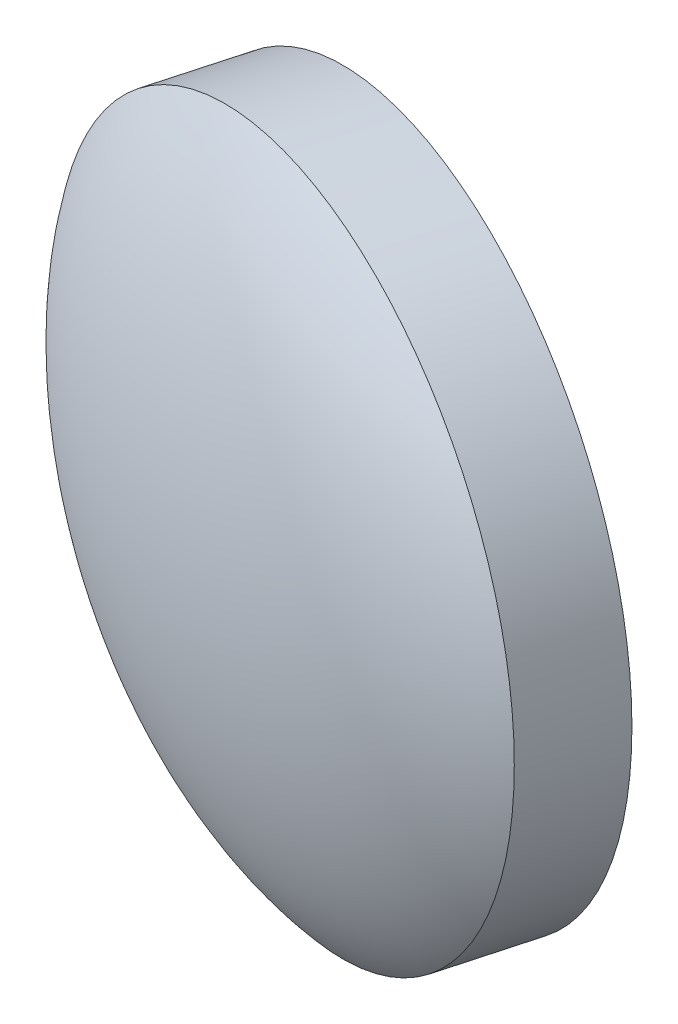
ISO-10303-21;
HEADER;
FILE_DESCRIPTION(('STEP AP214'),'2;1');
FILE_NAME('part.step','',(''),(''),'','','');
FILE_SCHEMA(('AUTOMOTIVE_DESIGN { 1 0 10303 214 1 1 1 1 }'));
ENDSEC;
DATA;
#1=APPLICATION_CONTEXT('core data for automotive mechanical design processes');
#2=APPLICATION_PROTOCOL_DEFINITION('international standard','automotive_design',2000,#1);
#3=PRODUCT_CONTEXT('',#1,'mechanical');
#4=PRODUCT('Part','Part','',(#3));
#5=PRODUCT_RELATED_PRODUCT_CATEGORY('part','',(#4));
#6=PRODUCT_DEFINITION_FORMATION('','',#4);
#7=PRODUCT_DEFINITION_CONTEXT('part definition',#1,'design');
#8=PRODUCT_DEFINITION('design','',#6,#7);
#9=PRODUCT_DEFINITION_SHAPE('','',#8);
#10=(LENGTH_UNIT() NAMED_UNIT(*) SI_UNIT(.MILLI.,.METRE.));
#11=(NAMED_UNIT(*) PLANE_ANGLE_UNIT() SI_UNIT($,.RADIAN.));
#12=(NAMED_UNIT(*) SI_UNIT($,.STERADIAN.) SOLID_ANGLE_UNIT());
#13=UNCERTAINTY_MEASURE_WITH_UNIT(LENGTH_MEASURE(1.E-05),#10,'distance_accuracy_value','');
#14=(GEOMETRIC_REPRESENTATION_CONTEXT(3) GLOBAL_UNCERTAINTY_ASSIGNED_CONTEXT((#13)) GLOBAL_UNIT_ASSIGNED_CONTEXT((#10,
#11,#12)) REPRESENTATION_CONTEXT('',''));
#15=CARTESIAN_POINT('',(0.,0.,0.));
#16=DIRECTION('',(0.,0.,1.));
#17=DIRECTION('',(1.,0.,0.));
#18=AXIS2_PLACEMENT_3D('',#15,#16,#17);
#19=CARTESIAN_POINT('',(-185.803418128199,0.,-51.0566088952039));
#20=DIRECTION('',(-0.264966713613981,0.,0.964257559304881));
#21=DIRECTION('',(0.964257559304881,0.,0.264966713613981));
#22=AXIS2_PLACEMENT_3D('',#19,#20,#21);
#23=PLANE('',#22);
#24=CARTESIAN_POINT('',(0.,0.,0.));
#25=DIRECTION('',(-0.264966713613981,0.,0.964257559304881));
#26=DIRECTION('',(0.964257559304881,0.,0.264966713613981));
#27=AXIS2_PLACEMENT_3D('',#24,#25,#26);
#28=CIRCLE('',#27,192.690652342038);
#29=CARTESIAN_POINT('',(185.803418128199,0.,51.0566088952039));
#30=VERTEX_POINT('',#29);
#31=EDGE_CURVE('E60',#30,#30,#28,.T.);
#32=ORIENTED_EDGE('',*,*,#31,.T.);
#33=EDGE_LOOP('',(#32));
#34=FACE_BOUND('',#33,.T.);
#35=CARTESIAN_POINT('',(0.,0.,0.));
#36=DIRECTION('',(-0.264966713613981,0.,0.964257559304881));
#37=DIRECTION('',(0.964257559304881,0.,0.264966713613981));
#38=AXIS2_PLACEMENT_3D('',#35,#36,#37);
#39=CIRCLE('',#38,194.690652342038);
#40=CARTESIAN_POINT('',(187.731933246808,0.,51.5865423224319));
#41=VERTEX_POINT('',#40);
#42=EDGE_CURVE('E11',#41,#41,#39,.T.);
#43=ORIENTED_EDGE('',*,*,#42,.F.);
#44=EDGE_LOOP('',(#43));
#45=FACE_BOUND('',#44,.T.);
#46=ADVANCED_FACE('F36',(#34,#45),#23,.F.);
#47=CARTESIAN_POINT('',(-29.4775468895554,0.,107.273653472668));
#48=DIRECTION('',(-0.264966713613981,0.,0.964257559304881));
#49=DIRECTION('',(0.964257559304881,0.,0.264966713613981));
#50=AXIS2_PLACEMENT_3D('',#47,#48,#49);
#51=CYLINDRICAL_SURFACE('',#50,194.690652342038);
#52=CARTESIAN_POINT('',(-14.9797428878167,0.,54.5137542712785));
#53=DIRECTION('',(-0.264966713613981,0.,0.964257559304881));
#54=DIRECTION('',(0.964257559304881,0.,0.264966713613981));
#55=AXIS2_PLACEMENT_3D('',#52,#53,#54);
#56=CIRCLE('',#55,194.690652342038);
#57=CARTESIAN_POINT('',(172.752190358992,0.,106.10029659371));
#58=VERTEX_POINT('',#57);
#59=EDGE_CURVE('E45',#58,#58,#56,.T.);
#60=ORIENTED_EDGE('',*,*,#59,.F.);
#61=EDGE_LOOP('',(#60));
#62=FACE_BOUND('',#61,.T.);
#63=ORIENTED_EDGE('',*,*,#42,.T.);
#64=EDGE_LOOP('',(#63));
#65=FACE_BOUND('',#64,.T.);
#66=ADVANCED_FACE('F72',(#62,#65),#51,.T.);
#67=CARTESIAN_POINT('',(0.,0.,0.));
#68=DIRECTION('',(0.,1.,0.));
#69=DIRECTION('',(-0.964257559304881,0.,-0.264966713613981));
#70=AXIS2_PLACEMENT_3D('',#67,#68,#69);
#71=ELLIPSE('',#70,222.5,111.25);
#72=TRIMMED_CURVE('',#71,(PARAMETER_VALUE(-1.5707963267949)),(PARAMETER_VALUE(1.5707963267949)),
.T.,.PARAMETER.);
#73=CARTESIAN_POINT('',(-29.4775468895554,0.,107.273653472668));
#74=DIRECTION('',(-0.264966713613981,0.,0.964257559304881));
#75=AXIS1_PLACEMENT('',#73,#74);
#76=SURFACE_OF_REVOLUTION('',#72,#75);
#77=OFFSET_SURFACE('',#76,2.,.F.);
#78=CARTESIAN_POINT('',(-30.0074803167834,0.,109.202168591278));
#79=VERTEX_POINT('',#78);
#80=VERTEX_LOOP('',#79);
#81=FACE_BOUND('',#80,.T.);
#82=ORIENTED_EDGE('',*,*,#59,.T.);
#83=EDGE_LOOP('',(#82));
#84=FACE_BOUND('',#83,.T.);
#85=ADVANCED_FACE('F70',(#81,#84),#77,.T.);
#86=CARTESIAN_POINT('',(-29.4775468895554,0.,107.273653472668));
#87=DIRECTION('',(-0.264966713613981,0.,0.964257559304881));
#88=DIRECTION('',(0.964257559304881,0.,0.264966713613981));
#89=AXIS2_PLACEMENT_3D('',#86,#87,#88);
#90=CYLINDRICAL_SURFACE('',#89,192.690652342038);
#91=CARTESIAN_POINT('',(-14.7387734447777,0.,53.6368267363341));
#92=DIRECTION('',(-0.264966713613981,0.,0.964257559304881));
#93=DIRECTION('',(0.964257559304881,0.,0.264966713613981));
#94=AXIS2_PLACEMENT_3D('',#91,#92,#93);
#95=CIRCLE('',#94,192.690652342038);
#96=CARTESIAN_POINT('',(171.064644683421,0.,104.693435631538));
#97=VERTEX_POINT('',#96);
#98=EDGE_CURVE('E58',#97,#97,#95,.T.);
#99=ORIENTED_EDGE('',*,*,#98,.T.);
#100=EDGE_LOOP('',(#99));
#101=FACE_BOUND('',#100,.T.);
#102=ORIENTED_EDGE('',*,*,#31,.F.);
#103=EDGE_LOOP('',(#102));
#104=FACE_BOUND('',#103,.T.);
#105=ADVANCED_FACE('F54',(#101,#104),#90,.F.);
#106=CARTESIAN_POINT('',(0.,0.,0.));
#107=DIRECTION('',(0.,1.,0.));
#108=DIRECTION('',(-0.964257559304881,0.,-0.264966713613981));
#109=AXIS2_PLACEMENT_3D('',#106,#107,#108);
#110=ELLIPSE('',#109,222.5,111.25);
#111=TRIMMED_CURVE('',#110,(PARAMETER_VALUE(-1.5707963267949)),
(PARAMETER_VALUE(1.5707963267949)),.T.,.PARAMETER.);
#112=CARTESIAN_POINT('',(-29.4775468895554,0.,107.273653472668));
#113=DIRECTION('',(-0.264966713613981,0.,0.964257559304881));
#114=AXIS1_PLACEMENT('',#112,#113);
#115=SURFACE_OF_REVOLUTION('',#111,#114);
#116=CARTESIAN_POINT('',(-29.4775468895554,0.,107.273653472668));
#117=VERTEX_POINT('',#116);
#118=VERTEX_LOOP('',#117);
#119=FACE_BOUND('',#118,.T.);
#120=ORIENTED_EDGE('',*,*,#98,.F.);
#121=EDGE_LOOP('',(#120));
#122=FACE_BOUND('',#121,.T.);
#123=ADVANCED_FACE('F51',(#119,#122),#115,.F.);
#124=CLOSED_SHELL('',(#46,#66,#85,#105,#123));
#125=MANIFOLD_SOLID_BREP('B2',#124);
#126=ADVANCED_BREP_SHAPE_REPRESENTATION('',(#18,#125),#14);
#127=SHAPE_DEFINITION_REPRESENTATION(#9,#126);
ENDSEC;
END-ISO-10303-21;
